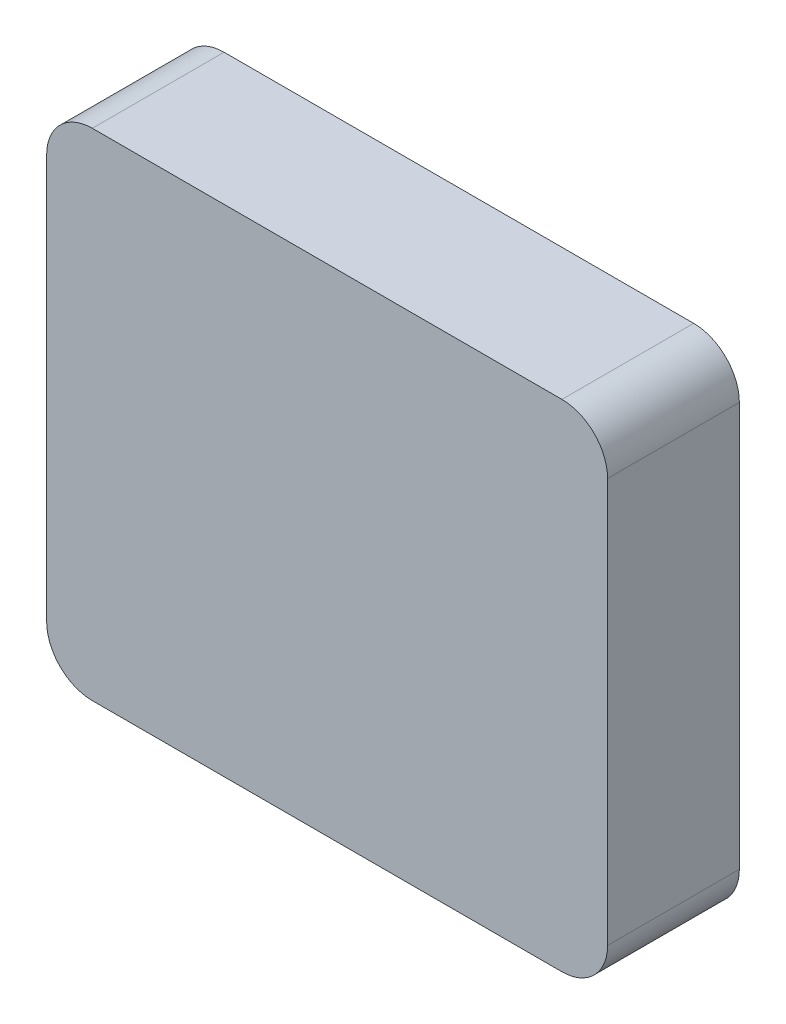
ISO-10303-21;
HEADER;
FILE_DESCRIPTION(('STEP AP214'),'2;1');
FILE_NAME('part.step','',(''),(''),'','','');
FILE_SCHEMA(('AUTOMOTIVE_DESIGN { 1 0 10303 214 1 1 1 1 }'));
ENDSEC;
DATA;
#1=APPLICATION_CONTEXT('core data for automotive mechanical design processes');
#2=APPLICATION_PROTOCOL_DEFINITION('international standard','automotive_design',2000,#1);
#3=PRODUCT_CONTEXT('',#1,'mechanical');
#4=PRODUCT('Part','Part','',(#3));
#5=PRODUCT_RELATED_PRODUCT_CATEGORY('part','',(#4));
#6=PRODUCT_DEFINITION_FORMATION('','',#4);
#7=PRODUCT_DEFINITION_CONTEXT('part definition',#1,'design');
#8=PRODUCT_DEFINITION('design','',#6,#7);
#9=PRODUCT_DEFINITION_SHAPE('','',#8);
#10=(LENGTH_UNIT() NAMED_UNIT(*) SI_UNIT(.MILLI.,.METRE.));
#11=(NAMED_UNIT(*) PLANE_ANGLE_UNIT() SI_UNIT($,.RADIAN.));
#12=(NAMED_UNIT(*) SI_UNIT($,.STERADIAN.) SOLID_ANGLE_UNIT());
#13=UNCERTAINTY_MEASURE_WITH_UNIT(LENGTH_MEASURE(1.E-05),#10,'distance_accuracy_value','');
#14=(GEOMETRIC_REPRESENTATION_CONTEXT(3) GLOBAL_UNCERTAINTY_ASSIGNED_CONTEXT((#13)) GLOBAL_UNIT_ASSIGNED_CONTEXT((#10,
#11,#12)) REPRESENTATION_CONTEXT('',''));
#15=CARTESIAN_POINT('',(0.,0.,0.));
#16=DIRECTION('',(0.,0.,1.));
#17=DIRECTION('',(1.,0.,0.));
#18=AXIS2_PLACEMENT_3D('',#15,#16,#17);
#19=CARTESIAN_POINT('',(-355.,-5.,0.));
#20=DIRECTION('',(0.,0.,1.));
#21=DIRECTION('',(1.,0.,0.));
#22=AXIS2_PLACEMENT_3D('',#19,#20,#21);
#23=PLANE('',#22);
#24=CARTESIAN_POINT('',(-355.,-5.,0.));
#25=DIRECTION('',(0.,0.,1.));
#26=DIRECTION('',(1.,0.,0.));
#27=AXIS2_PLACEMENT_3D('',#24,#25,#26);
#28=CIRCLE('',#27,35.);
#29=CARTESIAN_POINT('',(-390.,-5.00000000000001,0.));
#30=VERTEX_POINT('',#29);
#31=CARTESIAN_POINT('',(-355.,-40.,0.));
#32=VERTEX_POINT('',#31);
#33=EDGE_CURVE('E196',#30,#32,#28,.T.);
#34=ORIENTED_EDGE('',*,*,#33,.F.);
#35=DIRECTION('',(0.,-1.,0.));
#36=VECTOR('',#35,1.);
#37=CARTESIAN_POINT('',(-390.,305.,0.));
#38=LINE('',#37,#36);
#39=CARTESIAN_POINT('',(-390.,305.,0.));
#40=VERTEX_POINT('',#39);
#41=EDGE_CURVE('E56',#40,#30,#38,.T.);
#42=ORIENTED_EDGE('',*,*,#41,.F.);
#43=CARTESIAN_POINT('',(-355.,305.,0.));
#44=DIRECTION('',(0.,0.,1.));
#45=DIRECTION('',(1.,0.,0.));
#46=AXIS2_PLACEMENT_3D('',#43,#44,#45);
#47=CIRCLE('',#46,35.);
#48=CARTESIAN_POINT('',(-355.,340.,0.));
#49=VERTEX_POINT('',#48);
#50=EDGE_CURVE('E208',#49,#40,#47,.T.);
#51=ORIENTED_EDGE('',*,*,#50,.F.);
#52=DIRECTION('',(-1.,0.,0.));
#53=VECTOR('',#52,1.);
#54=CARTESIAN_POINT('',(-355.,340.,0.));
#55=LINE('',#54,#53);
#56=CARTESIAN_POINT('',(5.00000000000006,340.,0.));
#57=VERTEX_POINT('',#56);
#58=EDGE_CURVE('E206',#57,#49,#55,.T.);
#59=ORIENTED_EDGE('',*,*,#58,.F.);
#60=CARTESIAN_POINT('',(5.00000000000006,305.,0.));
#61=DIRECTION('',(0.,0.,1.));
#62=DIRECTION('',(-1.,0.,0.));
#63=AXIS2_PLACEMENT_3D('',#60,#61,#62);
#64=CIRCLE('',#63,35.);
#65=CARTESIAN_POINT('',(40.0000000000001,305.,0.));
#66=VERTEX_POINT('',#65);
#67=EDGE_CURVE('E204',#66,#57,#64,.T.);
#68=ORIENTED_EDGE('',*,*,#67,.F.);
#69=DIRECTION('',(0.,1.,0.));
#70=VECTOR('',#69,1.);
#71=CARTESIAN_POINT('',(40.0000000000001,305.,0.));
#72=LINE('',#71,#70);
#73=CARTESIAN_POINT('',(40.0000000000001,-5.00000000000005,0.));
#74=VERTEX_POINT('',#73);
#75=EDGE_CURVE('E202',#74,#66,#72,.T.);
#76=ORIENTED_EDGE('',*,*,#75,.F.);
#77=CARTESIAN_POINT('',(5.00000000000012,-5.00000000000005,0.));
#78=DIRECTION('',(0.,0.,1.));
#79=DIRECTION('',(1.,0.,0.));
#80=AXIS2_PLACEMENT_3D('',#77,#78,#79);
#81=CIRCLE('',#80,35.);
#82=CARTESIAN_POINT('',(5.00000000000011,-40.,0.));
#83=VERTEX_POINT('',#82);
#84=EDGE_CURVE('E132',#83,#74,#81,.T.);
#85=ORIENTED_EDGE('',*,*,#84,.F.);
#86=DIRECTION('',(1.,0.,0.));
#87=VECTOR('',#86,1.);
#88=CARTESIAN_POINT('',(-355.,-40.,0.));
#89=LINE('',#88,#87);
#90=EDGE_CURVE('E199',#32,#83,#89,.T.);
#91=ORIENTED_EDGE('',*,*,#90,.F.);
#92=EDGE_LOOP('',(#34,#42,#51,#59,#68,#76,#85,#91));
#93=FACE_BOUND('',#92,.T.);
#94=DIRECTION('',(0.,1.,0.));
#95=VECTOR('',#94,1.);
#96=CARTESIAN_POINT('',(0.,0.,0.));
#97=LINE('',#96,#95);
#98=CARTESIAN_POINT('',(0.,0.,0.));
#99=VERTEX_POINT('',#98);
#100=CARTESIAN_POINT('',(0.,300.,0.));
#101=VERTEX_POINT('',#100);
#102=EDGE_CURVE('E48',#99,#101,#97,.T.);
#103=ORIENTED_EDGE('',*,*,#102,.T.);
#104=DIRECTION('',(-1.,0.,0.));
#105=VECTOR('',#104,1.);
#106=CARTESIAN_POINT('',(0.,300.,0.));
#107=LINE('',#106,#105);
#108=CARTESIAN_POINT('',(-350.,300.,0.));
#109=VERTEX_POINT('',#108);
#110=EDGE_CURVE('E181',#101,#109,#107,.T.);
#111=ORIENTED_EDGE('',*,*,#110,.T.);
#112=DIRECTION('',(0.,-1.,0.));
#113=VECTOR('',#112,1.);
#114=CARTESIAN_POINT('',(-350.,0.,0.));
#115=LINE('',#114,#113);
#116=CARTESIAN_POINT('',(-350.,0.,0.));
#117=VERTEX_POINT('',#116);
#118=EDGE_CURVE('E184',#109,#117,#115,.T.);
#119=ORIENTED_EDGE('',*,*,#118,.T.);
#120=DIRECTION('',(1.,0.,0.));
#121=VECTOR('',#120,1.);
#122=CARTESIAN_POINT('',(0.,0.,0.));
#123=LINE('',#122,#121);
#124=EDGE_CURVE('E170',#117,#99,#123,.T.);
#125=ORIENTED_EDGE('',*,*,#124,.T.);
#126=EDGE_LOOP('',(#103,#111,#119,#125));
#127=FACE_BOUND('',#126,.T.);
#128=ADVANCED_FACE('F33',(#93,#127),#23,.F.);
#129=CARTESIAN_POINT('',(-355.,-5.,100.));
#130=DIRECTION('',(0.,0.,-1.));
#131=DIRECTION('',(-1.,0.,0.));
#132=AXIS2_PLACEMENT_3D('',#129,#130,#131);
#133=CYLINDRICAL_SURFACE('',#132,35.);
#134=ORIENTED_EDGE('',*,*,#33,.T.);
#135=DIRECTION('',(0.,0.,-1.));
#136=VECTOR('',#135,1.);
#137=CARTESIAN_POINT('',(-355.,-40.,100.));
#138=LINE('',#137,#136);
#139=CARTESIAN_POINT('',(-355.,-40.,101.));
#140=VERTEX_POINT('',#139);
#141=EDGE_CURVE('E11',#140,#32,#138,.T.);
#142=ORIENTED_EDGE('',*,*,#141,.F.);
#143=CARTESIAN_POINT('',(-355.,-5.,101.));
#144=DIRECTION('',(0.,0.,1.));
#145=DIRECTION('',(1.,0.,0.));
#146=AXIS2_PLACEMENT_3D('',#143,#144,#145);
#147=CIRCLE('',#146,35.);
#148=CARTESIAN_POINT('',(-390.,-5.,101.));
#149=VERTEX_POINT('',#148);
#150=EDGE_CURVE('E163',#149,#140,#147,.T.);
#151=ORIENTED_EDGE('',*,*,#150,.F.);
#152=DIRECTION('',(0.,0.,-1.));
#153=VECTOR('',#152,1.);
#154=CARTESIAN_POINT('',(-390.,-5.00000000000001,100.));
#155=LINE('',#154,#153);
#156=EDGE_CURVE('E211',#149,#30,#155,.T.);
#157=ORIENTED_EDGE('',*,*,#156,.T.);
#158=EDGE_LOOP('',(#134,#142,#151,#157));
#159=FACE_BOUND('',#158,.T.);
#160=ADVANCED_FACE('F35',(#159),#133,.T.);
#161=CARTESIAN_POINT('',(-355.,-40.,100.));
#162=DIRECTION('',(0.,1.,0.));
#163=DIRECTION('',(-1.,0.,0.));
#164=AXIS2_PLACEMENT_3D('',#161,#162,#163);
#165=PLANE('',#164);
#166=ORIENTED_EDGE('',*,*,#90,.T.);
#167=DIRECTION('',(0.,0.,-1.));
#168=VECTOR('',#167,1.);
#169=CARTESIAN_POINT('',(5.00000000000011,-40.,100.));
#170=LINE('',#169,#168);
#171=CARTESIAN_POINT('',(5.00000000000011,-40.,101.));
#172=VERTEX_POINT('',#171);
#173=EDGE_CURVE('E41',#172,#83,#170,.T.);
#174=ORIENTED_EDGE('',*,*,#173,.F.);
#175=DIRECTION('',(1.,0.,0.));
#176=VECTOR('',#175,1.);
#177=CARTESIAN_POINT('',(-355.,-40.,101.));
#178=LINE('',#177,#176);
#179=EDGE_CURVE('E150',#140,#172,#178,.T.);
#180=ORIENTED_EDGE('',*,*,#179,.F.);
#181=ORIENTED_EDGE('',*,*,#141,.T.);
#182=EDGE_LOOP('',(#166,#174,#180,#181));
#183=FACE_BOUND('',#182,.T.);
#184=ADVANCED_FACE('F240',(#183),#165,.F.);
#185=CARTESIAN_POINT('',(5.00000000000012,-5.00000000000005,100.));
#186=DIRECTION('',(0.,0.,-1.));
#187=DIRECTION('',(-1.,0.,0.));
#188=AXIS2_PLACEMENT_3D('',#185,#186,#187);
#189=CYLINDRICAL_SURFACE('',#188,35.);
#190=ORIENTED_EDGE('',*,*,#84,.T.);
#191=DIRECTION('',(0.,0.,-1.));
#192=VECTOR('',#191,1.);
#193=CARTESIAN_POINT('',(40.0000000000001,-5.00000000000005,100.));
#194=LINE('',#193,#192);
#195=CARTESIAN_POINT('',(40.0000000000001,-5.00000000000005,101.));
#196=VERTEX_POINT('',#195);
#197=EDGE_CURVE('E125',#196,#74,#194,.T.);
#198=ORIENTED_EDGE('',*,*,#197,.F.);
#199=CARTESIAN_POINT('',(5.00000000000012,-5.00000000000005,101.));
#200=DIRECTION('',(0.,0.,1.));
#201=DIRECTION('',(1.,0.,0.));
#202=AXIS2_PLACEMENT_3D('',#199,#200,#201);
#203=CIRCLE('',#202,35.);
#204=EDGE_CURVE('E130',#172,#196,#203,.T.);
#205=ORIENTED_EDGE('',*,*,#204,.F.);
#206=ORIENTED_EDGE('',*,*,#173,.T.);
#207=EDGE_LOOP('',(#190,#198,#205,#206));
#208=FACE_BOUND('',#207,.T.);
#209=ADVANCED_FACE('F127',(#208),#189,.T.);
#210=CARTESIAN_POINT('',(40.0000000000001,305.,100.));
#211=DIRECTION('',(-1.,0.,0.));
#212=DIRECTION('',(0.,0.,1.));
#213=AXIS2_PLACEMENT_3D('',#210,#211,#212);
#214=PLANE('',#213);
#215=ORIENTED_EDGE('',*,*,#75,.T.);
#216=DIRECTION('',(0.,0.,-1.));
#217=VECTOR('',#216,1.);
#218=CARTESIAN_POINT('',(40.0000000000001,305.,100.));
#219=LINE('',#218,#217);
#220=CARTESIAN_POINT('',(40.0000000000001,305.,101.));
#221=VERTEX_POINT('',#220);
#222=EDGE_CURVE('E135',#221,#66,#219,.T.);
#223=ORIENTED_EDGE('',*,*,#222,.F.);
#224=DIRECTION('',(0.,1.,0.));
#225=VECTOR('',#224,1.);
#226=CARTESIAN_POINT('',(40.0000000000001,-5.00000000000005,101.));
#227=LINE('',#226,#225);
#228=EDGE_CURVE('E138',#196,#221,#227,.T.);
#229=ORIENTED_EDGE('',*,*,#228,.F.);
#230=ORIENTED_EDGE('',*,*,#197,.T.);
#231=EDGE_LOOP('',(#215,#223,#229,#230));
#232=FACE_BOUND('',#231,.T.);
#233=ADVANCED_FACE('F139',(#232),#214,.F.);
#234=CARTESIAN_POINT('',(5.00000000000006,305.,100.));
#235=DIRECTION('',(0.,0.,-1.));
#236=DIRECTION('',(-1.,0.,0.));
#237=AXIS2_PLACEMENT_3D('',#234,#235,#236);
#238=CYLINDRICAL_SURFACE('',#237,35.);
#239=ORIENTED_EDGE('',*,*,#67,.T.);
#240=DIRECTION('',(0.,0.,-1.));
#241=VECTOR('',#240,1.);
#242=CARTESIAN_POINT('',(5.00000000000006,340.,100.));
#243=LINE('',#242,#241);
#244=CARTESIAN_POINT('',(5.00000000000006,340.,101.));
#245=VERTEX_POINT('',#244);
#246=EDGE_CURVE('E218',#245,#57,#243,.T.);
#247=ORIENTED_EDGE('',*,*,#246,.F.);
#248=CARTESIAN_POINT('',(5.00000000000006,305.,101.));
#249=DIRECTION('',(0.,0.,1.));
#250=DIRECTION('',(1.,0.,0.));
#251=AXIS2_PLACEMENT_3D('',#248,#249,#250);
#252=CIRCLE('',#251,35.);
#253=EDGE_CURVE('E144',#221,#245,#252,.T.);
#254=ORIENTED_EDGE('',*,*,#253,.F.);
#255=ORIENTED_EDGE('',*,*,#222,.T.);
#256=EDGE_LOOP('',(#239,#247,#254,#255));
#257=FACE_BOUND('',#256,.T.);
#258=ADVANCED_FACE('F228',(#257),#238,.T.);
#259=CARTESIAN_POINT('',(-355.,340.,100.));
#260=DIRECTION('',(0.,-1.,0.));
#261=DIRECTION('',(0.,0.,-1.));
#262=AXIS2_PLACEMENT_3D('',#259,#260,#261);
#263=PLANE('',#262);
#264=ORIENTED_EDGE('',*,*,#58,.T.);
#265=DIRECTION('',(0.,0.,-1.));
#266=VECTOR('',#265,1.);
#267=CARTESIAN_POINT('',(-355.,340.,100.));
#268=LINE('',#267,#266);
#269=CARTESIAN_POINT('',(-355.,340.,101.));
#270=VERTEX_POINT('',#269);
#271=EDGE_CURVE('E215',#270,#49,#268,.T.);
#272=ORIENTED_EDGE('',*,*,#271,.F.);
#273=DIRECTION('',(-1.,0.,0.));
#274=VECTOR('',#273,1.);
#275=CARTESIAN_POINT('',(5.00000000000006,340.,101.));
#276=LINE('',#275,#274);
#277=EDGE_CURVE('E154',#245,#270,#276,.T.);
#278=ORIENTED_EDGE('',*,*,#277,.F.);
#279=ORIENTED_EDGE('',*,*,#246,.T.);
#280=EDGE_LOOP('',(#264,#272,#278,#279));
#281=FACE_BOUND('',#280,.T.);
#282=ADVANCED_FACE('F232',(#281),#263,.F.);
#283=CARTESIAN_POINT('',(-355.,305.,100.));
#284=DIRECTION('',(0.,0.,-1.));
#285=DIRECTION('',(-1.,0.,0.));
#286=AXIS2_PLACEMENT_3D('',#283,#284,#285);
#287=CYLINDRICAL_SURFACE('',#286,35.);
#288=ORIENTED_EDGE('',*,*,#50,.T.);
#289=DIRECTION('',(0.,0.,-1.));
#290=VECTOR('',#289,1.);
#291=CARTESIAN_POINT('',(-390.,305.,100.));
#292=LINE('',#291,#290);
#293=CARTESIAN_POINT('',(-390.,305.,101.));
#294=VERTEX_POINT('',#293);
#295=EDGE_CURVE('E213',#294,#40,#292,.T.);
#296=ORIENTED_EDGE('',*,*,#295,.F.);
#297=CARTESIAN_POINT('',(-355.,305.,101.));
#298=DIRECTION('',(0.,0.,1.));
#299=DIRECTION('',(1.,0.,0.));
#300=AXIS2_PLACEMENT_3D('',#297,#298,#299);
#301=CIRCLE('',#300,35.);
#302=EDGE_CURVE('E157',#270,#294,#301,.T.);
#303=ORIENTED_EDGE('',*,*,#302,.F.);
#304=ORIENTED_EDGE('',*,*,#271,.T.);
#305=EDGE_LOOP('',(#288,#296,#303,#304));
#306=FACE_BOUND('',#305,.T.);
#307=ADVANCED_FACE('F235',(#306),#287,.T.);
#308=CARTESIAN_POINT('',(-390.,305.,100.));
#309=DIRECTION('',(1.,0.,0.));
#310=DIRECTION('',(0.,1.,0.));
#311=AXIS2_PLACEMENT_3D('',#308,#309,#310);
#312=PLANE('',#311);
#313=ORIENTED_EDGE('',*,*,#41,.T.);
#314=ORIENTED_EDGE('',*,*,#156,.F.);
#315=DIRECTION('',(0.,-1.,0.));
#316=VECTOR('',#315,1.);
#317=CARTESIAN_POINT('',(-390.,305.,101.));
#318=LINE('',#317,#316);
#319=EDGE_CURVE('E160',#294,#149,#318,.T.);
#320=ORIENTED_EDGE('',*,*,#319,.F.);
#321=ORIENTED_EDGE('',*,*,#295,.T.);
#322=EDGE_LOOP('',(#313,#314,#320,#321));
#323=FACE_BOUND('',#322,.T.);
#324=ADVANCED_FACE('F239',(#323),#312,.F.);
#325=CARTESIAN_POINT('',(0.,0.,100.));
#326=DIRECTION('',(-1.,0.,0.));
#327=DIRECTION('',(0.,0.,1.));
#328=AXIS2_PLACEMENT_3D('',#325,#326,#327);
#329=PLANE('',#328);
#330=ORIENTED_EDGE('',*,*,#102,.F.);
#331=DIRECTION('',(0.,0.,-1.));
#332=VECTOR('',#331,1.);
#333=CARTESIAN_POINT('',(0.,0.,100.));
#334=LINE('',#333,#332);
#335=CARTESIAN_POINT('',(0.,0.,100.));
#336=VERTEX_POINT('',#335);
#337=EDGE_CURVE('E179',#336,#99,#334,.T.);
#338=ORIENTED_EDGE('',*,*,#337,.F.);
#339=DIRECTION('',(0.,1.,0.));
#340=VECTOR('',#339,1.);
#341=CARTESIAN_POINT('',(0.,0.,100.));
#342=LINE('',#341,#340);
#343=CARTESIAN_POINT('',(0.,300.,100.));
#344=VERTEX_POINT('',#343);
#345=EDGE_CURVE('E166',#336,#344,#342,.T.);
#346=ORIENTED_EDGE('',*,*,#345,.T.);
#347=DIRECTION('',(0.,0.,-1.));
#348=VECTOR('',#347,1.);
#349=CARTESIAN_POINT('',(0.,300.,100.));
#350=LINE('',#349,#348);
#351=EDGE_CURVE('E194',#344,#101,#350,.T.);
#352=ORIENTED_EDGE('',*,*,#351,.T.);
#353=EDGE_LOOP('',(#330,#338,#346,#352));
#354=FACE_BOUND('',#353,.T.);
#355=ADVANCED_FACE('F253',(#354),#329,.T.);
#356=CARTESIAN_POINT('',(0.,300.,100.));
#357=DIRECTION('',(0.,-1.,0.));
#358=DIRECTION('',(0.,0.,-1.));
#359=AXIS2_PLACEMENT_3D('',#356,#357,#358);
#360=PLANE('',#359);
#361=ORIENTED_EDGE('',*,*,#110,.F.);
#362=ORIENTED_EDGE('',*,*,#351,.F.);
#363=DIRECTION('',(-1.,0.,0.));
#364=VECTOR('',#363,1.);
#365=CARTESIAN_POINT('',(0.,300.,100.));
#366=LINE('',#365,#364);
#367=CARTESIAN_POINT('',(-350.,300.,100.));
#368=VERTEX_POINT('',#367);
#369=EDGE_CURVE('E169',#344,#368,#366,.T.);
#370=ORIENTED_EDGE('',*,*,#369,.T.);
#371=DIRECTION('',(0.,0.,-1.));
#372=VECTOR('',#371,1.);
#373=CARTESIAN_POINT('',(-350.,300.,100.));
#374=LINE('',#373,#372);
#375=EDGE_CURVE('E192',#368,#109,#374,.T.);
#376=ORIENTED_EDGE('',*,*,#375,.T.);
#377=EDGE_LOOP('',(#361,#362,#370,#376));
#378=FACE_BOUND('',#377,.T.);
#379=ADVANCED_FACE('F290',(#378),#360,.T.);
#380=CARTESIAN_POINT('',(-350.,0.,100.));
#381=DIRECTION('',(1.,0.,0.));
#382=DIRECTION('',(0.,0.,-1.));
#383=AXIS2_PLACEMENT_3D('',#380,#381,#382);
#384=PLANE('',#383);
#385=ORIENTED_EDGE('',*,*,#118,.F.);
#386=ORIENTED_EDGE('',*,*,#375,.F.);
#387=DIRECTION('',(0.,-1.,0.));
#388=VECTOR('',#387,1.);
#389=CARTESIAN_POINT('',(-350.,0.,100.));
#390=LINE('',#389,#388);
#391=CARTESIAN_POINT('',(-350.,0.,100.));
#392=VERTEX_POINT('',#391);
#393=EDGE_CURVE('E173',#368,#392,#390,.T.);
#394=ORIENTED_EDGE('',*,*,#393,.T.);
#395=DIRECTION('',(0.,0.,-1.));
#396=VECTOR('',#395,1.);
#397=CARTESIAN_POINT('',(-350.,0.,100.));
#398=LINE('',#397,#396);
#399=EDGE_CURVE('E190',#392,#117,#398,.T.);
#400=ORIENTED_EDGE('',*,*,#399,.T.);
#401=EDGE_LOOP('',(#385,#386,#394,#400));
#402=FACE_BOUND('',#401,.T.);
#403=ADVANCED_FACE('F296',(#402),#384,.T.);
#404=CARTESIAN_POINT('',(0.,0.,100.));
#405=DIRECTION('',(0.,1.,0.));
#406=DIRECTION('',(0.,0.,1.));
#407=AXIS2_PLACEMENT_3D('',#404,#405,#406);
#408=PLANE('',#407);
#409=ORIENTED_EDGE('',*,*,#124,.F.);
#410=ORIENTED_EDGE('',*,*,#399,.F.);
#411=DIRECTION('',(1.,0.,0.));
#412=VECTOR('',#411,1.);
#413=CARTESIAN_POINT('',(0.,0.,100.));
#414=LINE('',#413,#412);
#415=EDGE_CURVE('E176',#392,#336,#414,.T.);
#416=ORIENTED_EDGE('',*,*,#415,.T.);
#417=ORIENTED_EDGE('',*,*,#337,.T.);
#418=EDGE_LOOP('',(#409,#410,#416,#417));
#419=FACE_BOUND('',#418,.T.);
#420=ADVANCED_FACE('F303',(#419),#408,.T.);
#421=CARTESIAN_POINT('',(5.00000000000012,-5.00000000000005,100.));
#422=DIRECTION('',(0.,0.,1.));
#423=DIRECTION('',(1.,0.,0.));
#424=AXIS2_PLACEMENT_3D('',#421,#422,#423);
#425=PLANE('',#424);
#426=ORIENTED_EDGE('',*,*,#345,.F.);
#427=ORIENTED_EDGE('',*,*,#415,.F.);
#428=ORIENTED_EDGE('',*,*,#393,.F.);
#429=ORIENTED_EDGE('',*,*,#369,.F.);
#430=EDGE_LOOP('',(#426,#427,#428,#429));
#431=FACE_BOUND('',#430,.T.);
#432=ADVANCED_FACE('F311',(#431),#425,.F.);
#433=CARTESIAN_POINT('',(5.00000000000012,-5.00000000000005,101.));
#434=DIRECTION('',(0.,0.,1.));
#435=DIRECTION('',(1.,0.,0.));
#436=AXIS2_PLACEMENT_3D('',#433,#434,#435);
#437=PLANE('',#436);
#438=ORIENTED_EDGE('',*,*,#204,.T.);
#439=ORIENTED_EDGE('',*,*,#228,.T.);
#440=ORIENTED_EDGE('',*,*,#253,.T.);
#441=ORIENTED_EDGE('',*,*,#277,.T.);
#442=ORIENTED_EDGE('',*,*,#302,.T.);
#443=ORIENTED_EDGE('',*,*,#319,.T.);
#444=ORIENTED_EDGE('',*,*,#150,.T.);
#445=ORIENTED_EDGE('',*,*,#179,.T.);
#446=EDGE_LOOP('',(#438,#439,#440,#441,#442,#443,#444,#445));
#447=FACE_BOUND('',#446,.T.);
#448=ADVANCED_FACE('F147',(#447),#437,.T.);
#449=CLOSED_SHELL('',(#128,#160,#184,#209,#233,#258,#282,#307,#324,#355,#379,#403,#420,#432,#448));
#450=MANIFOLD_SOLID_BREP('B2',#449);
#451=ADVANCED_BREP_SHAPE_REPRESENTATION('',(#18,#450),#14);
#452=SHAPE_DEFINITION_REPRESENTATION(#9,#451);
ENDSEC;
END-ISO-10303-21;
